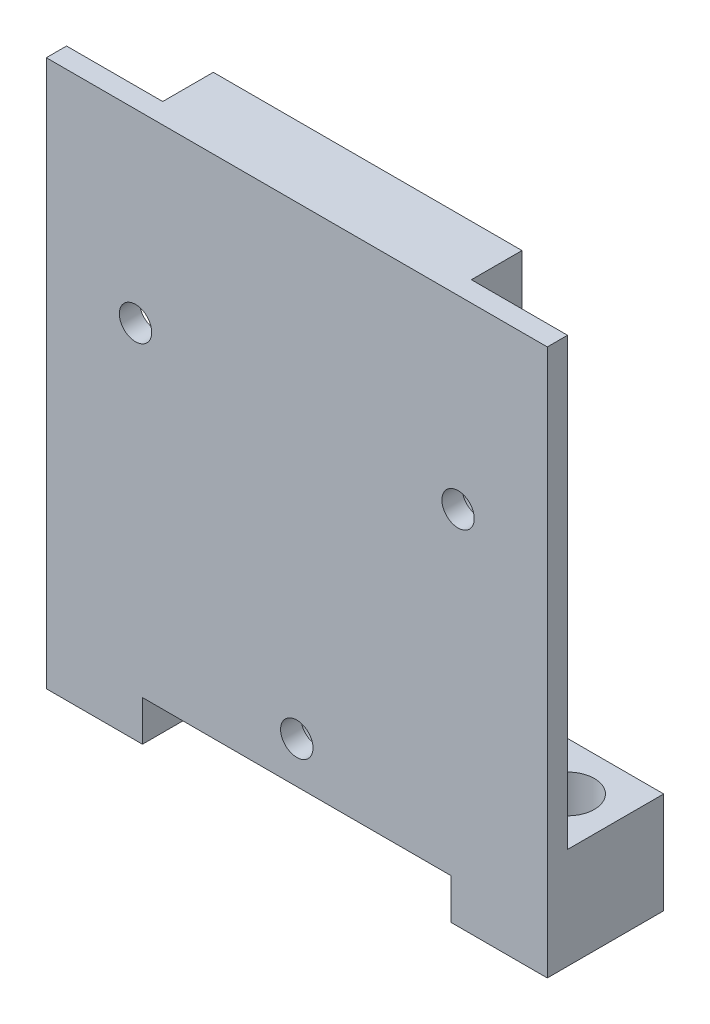
ISO-10303-21;
HEADER;
FILE_DESCRIPTION(('STEP AP214'),'2;1');
FILE_NAME('part.step','',(''),(''),'','','');
FILE_SCHEMA(('AUTOMOTIVE_DESIGN { 1 0 10303 214 1 1 1 1 }'));
ENDSEC;
DATA;
#1=APPLICATION_CONTEXT('core data for automotive mechanical design processes');
#2=APPLICATION_PROTOCOL_DEFINITION('international standard','automotive_design',2000,#1);
#3=PRODUCT_CONTEXT('',#1,'mechanical');
#4=PRODUCT('Part','Part','',(#3));
#5=PRODUCT_RELATED_PRODUCT_CATEGORY('part','',(#4));
#6=PRODUCT_DEFINITION_FORMATION('','',#4);
#7=PRODUCT_DEFINITION_CONTEXT('part definition',#1,'design');
#8=PRODUCT_DEFINITION('design','',#6,#7);
#9=PRODUCT_DEFINITION_SHAPE('','',#8);
#10=(LENGTH_UNIT() NAMED_UNIT(*) SI_UNIT(.MILLI.,.METRE.));
#11=(NAMED_UNIT(*) PLANE_ANGLE_UNIT() SI_UNIT($,.RADIAN.));
#12=(NAMED_UNIT(*) SI_UNIT($,.STERADIAN.) SOLID_ANGLE_UNIT());
#13=UNCERTAINTY_MEASURE_WITH_UNIT(LENGTH_MEASURE(1.E-05),#10,'distance_accuracy_value','');
#14=(GEOMETRIC_REPRESENTATION_CONTEXT(3) GLOBAL_UNCERTAINTY_ASSIGNED_CONTEXT((#13)) GLOBAL_UNIT_ASSIGNED_CONTEXT((#10,
#11,#12)) REPRESENTATION_CONTEXT('',''));
#15=CARTESIAN_POINT('',(0.,0.,0.));
#16=DIRECTION('',(0.,0.,1.));
#17=DIRECTION('',(1.,0.,0.));
#18=AXIS2_PLACEMENT_3D('',#15,#16,#17);
#19=CARTESIAN_POINT('',(0.,4.,2.));
#20=DIRECTION('',(0.,1.,0.));
#21=DIRECTION('',(0.,0.,1.));
#22=AXIS2_PLACEMENT_3D('',#19,#20,#21);
#23=PLANE('',#22);
#24=DIRECTION('',(0.,0.,1.));
#25=VECTOR('',#24,1.);
#26=CARTESIAN_POINT('',(40.,4.,-5.));
#27=LINE('',#26,#25);
#28=CARTESIAN_POINT('',(40.,4.,-5.));
#29=VERTEX_POINT('',#28);
#30=CARTESIAN_POINT('',(40.,4.,2.));
#31=VERTEX_POINT('',#30);
#32=EDGE_CURVE('E54',#29,#31,#27,.T.);
#33=ORIENTED_EDGE('',*,*,#32,.T.);
#34=DIRECTION('',(1.,0.,0.));
#35=VECTOR('',#34,1.);
#36=CARTESIAN_POINT('',(0.,4.,2.));
#37=LINE('',#36,#35);
#38=CARTESIAN_POINT('',(9.5,4.,2.));
#39=VERTEX_POINT('',#38);
#40=EDGE_CURVE('E193',#39,#31,#37,.T.);
#41=ORIENTED_EDGE('',*,*,#40,.F.);
#42=DIRECTION('',(0.,0.,1.));
#43=VECTOR('',#42,1.);
#44=CARTESIAN_POINT('',(9.5,4.,-5.));
#45=LINE('',#44,#43);
#46=CARTESIAN_POINT('',(9.5,4.,-5.));
#47=VERTEX_POINT('',#46);
#48=EDGE_CURVE('E62',#47,#39,#45,.T.);
#49=ORIENTED_EDGE('',*,*,#48,.F.);
#50=DIRECTION('',(-1.,0.,0.));
#51=VECTOR('',#50,1.);
#52=CARTESIAN_POINT('',(0.,4.,-5.));
#53=LINE('',#52,#51);
#54=EDGE_CURVE('E225',#29,#47,#53,.T.);
#55=ORIENTED_EDGE('',*,*,#54,.F.);
#56=EDGE_LOOP('',(#33,#41,#49,#55));
#57=FACE_BOUND('',#56,.T.);
#58=ADVANCED_FACE('F39',(#57),#23,.F.);
#59=CARTESIAN_POINT('',(9.5,10.,-9.5));
#60=DIRECTION('',(-1.,0.,0.));
#61=DIRECTION('',(0.,0.,1.));
#62=AXIS2_PLACEMENT_3D('',#59,#60,#61);
#63=PLANE('',#62);
#64=ORIENTED_EDGE('',*,*,#48,.T.);
#65=DIRECTION('',(0.,-1.,0.));
#66=VECTOR('',#65,1.);
#67=CARTESIAN_POINT('',(9.5,4.,2.));
#68=LINE('',#67,#66);
#69=CARTESIAN_POINT('',(9.5,0.,2.));
#70=VERTEX_POINT('',#69);
#71=EDGE_CURVE('E194',#39,#70,#68,.T.);
#72=ORIENTED_EDGE('',*,*,#71,.T.);
#73=DIRECTION('',(0.,0.,-1.));
#74=VECTOR('',#73,1.);
#75=CARTESIAN_POINT('',(9.5,0.,-9.5));
#76=LINE('',#75,#74);
#77=CARTESIAN_POINT('',(9.5,0.,-9.5));
#78=VERTEX_POINT('',#77);
#79=EDGE_CURVE('E343',#70,#78,#76,.T.);
#80=ORIENTED_EDGE('',*,*,#79,.T.);
#81=DIRECTION('',(0.,-1.,0.));
#82=VECTOR('',#81,1.);
#83=CARTESIAN_POINT('',(9.5,10.,-9.5));
#84=LINE('',#83,#82);
#85=CARTESIAN_POINT('',(9.5,10.,-9.5));
#86=VERTEX_POINT('',#85);
#87=EDGE_CURVE('E348',#86,#78,#84,.T.);
#88=ORIENTED_EDGE('',*,*,#87,.F.);
#89=DIRECTION('',(0.,0.,-1.));
#90=VECTOR('',#89,1.);
#91=CARTESIAN_POINT('',(9.5,10.,-9.5));
#92=LINE('',#91,#90);
#93=CARTESIAN_POINT('',(9.5,10.,-5.));
#94=VERTEX_POINT('',#93);
#95=EDGE_CURVE('E335',#94,#86,#92,.T.);
#96=ORIENTED_EDGE('',*,*,#95,.F.);
#97=DIRECTION('',(0.,1.,0.));
#98=VECTOR('',#97,1.);
#99=CARTESIAN_POINT('',(9.5,0.,-5.));
#100=LINE('',#99,#98);
#101=EDGE_CURVE('E228',#47,#94,#100,.T.);
#102=ORIENTED_EDGE('',*,*,#101,.F.);
#103=EDGE_LOOP('',(#64,#72,#80,#88,#96,#102));
#104=FACE_BOUND('',#103,.T.);
#105=ADVANCED_FACE('F381',(#104),#63,.F.);
#106=CARTESIAN_POINT('',(0.,0.,0.));
#107=DIRECTION('',(0.,0.,-1.));
#108=DIRECTION('',(-1.,0.,0.));
#109=AXIS2_PLACEMENT_3D('',#106,#107,#108);
#110=PLANE('',#109);
#111=CARTESIAN_POINT('',(40.6848674296337,35.6999999999998,0.));
#112=DIRECTION('',(0.,0.,-1.));
#113=DIRECTION('',(-1.,0.,0.));
#114=AXIS2_PLACEMENT_3D('',#111,#112,#113);
#115=CIRCLE('',#114,1.6);
#116=CARTESIAN_POINT('',(39.0848674296337,35.6999999999998,0.));
#117=VERTEX_POINT('',#116);
#118=EDGE_CURVE('E272',#117,#117,#115,.T.);
#119=ORIENTED_EDGE('',*,*,#118,.F.);
#120=EDGE_LOOP('',(#119));
#121=FACE_BOUND('',#120,.T.);
#122=CARTESIAN_POINT('',(40.6848674296337,35.6999999999998,0.));
#123=DIRECTION('',(0.,0.,-1.));
#124=DIRECTION('',(-1.,0.,0.));
#125=AXIS2_PLACEMENT_3D('',#122,#123,#124);
#126=CIRCLE('',#125,3.);
#127=CARTESIAN_POINT('',(40.,32.779219863833,0.));
#128=VERTEX_POINT('',#127);
#129=CARTESIAN_POINT('',(40.,38.6207801361667,0.));
#130=VERTEX_POINT('',#129);
#131=EDGE_CURVE('E240',#128,#130,#126,.T.);
#132=ORIENTED_EDGE('',*,*,#131,.T.);
#133=DIRECTION('',(0.,-1.,0.));
#134=VECTOR('',#133,1.);
#135=CARTESIAN_POINT('',(40.,0.,0.));
#136=LINE('',#135,#134);
#137=CARTESIAN_POINT('',(40.,54.,0.));
#138=VERTEX_POINT('',#137);
#139=EDGE_CURVE('E237',#138,#130,#136,.T.);
#140=ORIENTED_EDGE('',*,*,#139,.F.);
#141=DIRECTION('',(-1.,0.,0.));
#142=VECTOR('',#141,1.);
#143=CARTESIAN_POINT('',(0.,54.,0.));
#144=LINE('',#143,#142);
#145=CARTESIAN_POINT('',(49.5,54.,0.));
#146=VERTEX_POINT('',#145);
#147=EDGE_CURVE('E303',#146,#138,#144,.T.);
#148=ORIENTED_EDGE('',*,*,#147,.F.);
#149=DIRECTION('',(0.,1.,0.));
#150=VECTOR('',#149,1.);
#151=CARTESIAN_POINT('',(49.5,4.,0.));
#152=LINE('',#151,#150);
#153=CARTESIAN_POINT('',(49.5,10.,0.));
#154=VERTEX_POINT('',#153);
#155=EDGE_CURVE('E312',#154,#146,#152,.T.);
#156=ORIENTED_EDGE('',*,*,#155,.F.);
#157=DIRECTION('',(1.,0.,0.));
#158=VECTOR('',#157,1.);
#159=CARTESIAN_POINT('',(40.,10.,0.));
#160=LINE('',#159,#158);
#161=CARTESIAN_POINT('',(40.,10.,0.));
#162=VERTEX_POINT('',#161);
#163=EDGE_CURVE('E285',#162,#154,#160,.T.);
#164=ORIENTED_EDGE('',*,*,#163,.F.);
#165=EDGE_CURVE('E241',#128,#162,#136,.T.);
#166=ORIENTED_EDGE('',*,*,#165,.F.);
#167=EDGE_LOOP('',(#132,#140,#148,#156,#164,#166));
#168=FACE_BOUND('',#167,.T.);
#169=ADVANCED_FACE('F399',(#121,#168),#110,.T.);
#170=CARTESIAN_POINT('',(24.75,8.10000000000001,0.));
#171=DIRECTION('',(0.,0.,-1.));
#172=DIRECTION('',(-1.,0.,0.));
#173=AXIS2_PLACEMENT_3D('',#170,#171,#172);
#174=CIRCLE('',#173,3.);
#175=CARTESIAN_POINT('',(21.75,8.10000000000001,0.));
#176=VERTEX_POINT('',#175);
#177=EDGE_CURVE('E11',#176,#176,#174,.F.);
#178=ORIENTED_EDGE('',*,*,#177,.F.);
#179=EDGE_LOOP('',(#178));
#180=FACE_BOUND('',#179,.T.);
#181=CARTESIAN_POINT('',(24.75,8.10000000000001,0.));
#182=DIRECTION('',(0.,0.,-1.));
#183=DIRECTION('',(-1.,0.,0.));
#184=AXIS2_PLACEMENT_3D('',#181,#182,#183);
#185=CIRCLE('',#184,1.6);
#186=CARTESIAN_POINT('',(23.15,8.10000000000001,0.));
#187=VERTEX_POINT('',#186);
#188=EDGE_CURVE('E264',#187,#187,#185,.T.);
#189=ORIENTED_EDGE('',*,*,#188,.F.);
#190=EDGE_LOOP('',(#189));
#191=FACE_BOUND('',#190,.T.);
#192=ADVANCED_FACE('F435',(#180,#191),#110,.T.);
#193=CARTESIAN_POINT('',(40.,10.,-9.5));
#194=DIRECTION('',(1.,0.,0.));
#195=DIRECTION('',(0.,0.,-1.));
#196=AXIS2_PLACEMENT_3D('',#193,#194,#195);
#197=PLANE('',#196);
#198=ORIENTED_EDGE('',*,*,#32,.F.);
#199=DIRECTION('',(0.,1.,0.));
#200=VECTOR('',#199,1.);
#201=CARTESIAN_POINT('',(40.,10.,-5.));
#202=LINE('',#201,#200);
#203=CARTESIAN_POINT('',(40.,10.,-5.));
#204=VERTEX_POINT('',#203);
#205=EDGE_CURVE('E47',#29,#204,#202,.T.);
#206=ORIENTED_EDGE('',*,*,#205,.T.);
#207=DIRECTION('',(0.,0.,1.));
#208=VECTOR('',#207,1.);
#209=CARTESIAN_POINT('',(40.,10.,-9.5));
#210=LINE('',#209,#208);
#211=CARTESIAN_POINT('',(40.,10.,-9.5));
#212=VERTEX_POINT('',#211);
#213=EDGE_CURVE('E282',#212,#204,#210,.T.);
#214=ORIENTED_EDGE('',*,*,#213,.F.);
#215=DIRECTION('',(0.,-1.,0.));
#216=VECTOR('',#215,1.);
#217=CARTESIAN_POINT('',(40.,10.,-9.5));
#218=LINE('',#217,#216);
#219=CARTESIAN_POINT('',(40.,0.,-9.5));
#220=VERTEX_POINT('',#219);
#221=EDGE_CURVE('E181',#212,#220,#218,.T.);
#222=ORIENTED_EDGE('',*,*,#221,.T.);
#223=DIRECTION('',(0.,0.,1.));
#224=VECTOR('',#223,1.);
#225=CARTESIAN_POINT('',(40.,0.,-9.5));
#226=LINE('',#225,#224);
#227=CARTESIAN_POINT('',(40.,0.,2.));
#228=VERTEX_POINT('',#227);
#229=EDGE_CURVE('E175',#220,#228,#226,.T.);
#230=ORIENTED_EDGE('',*,*,#229,.T.);
#231=DIRECTION('',(0.,1.,0.));
#232=VECTOR('',#231,1.);
#233=CARTESIAN_POINT('',(40.,4.,2.));
#234=LINE('',#233,#232);
#235=EDGE_CURVE('E178',#228,#31,#234,.T.);
#236=ORIENTED_EDGE('',*,*,#235,.T.);
#237=EDGE_LOOP('',(#198,#206,#214,#222,#230,#236));
#238=FACE_BOUND('',#237,.T.);
#239=ADVANCED_FACE('F177',(#238),#197,.F.);
#240=CARTESIAN_POINT('',(0.,10.,0.));
#241=DIRECTION('',(0.,1.,0.));
#242=DIRECTION('',(0.,0.,1.));
#243=AXIS2_PLACEMENT_3D('',#240,#241,#242);
#244=PLANE('',#243);
#245=DIRECTION('',(0.,0.,1.));
#246=VECTOR('',#245,1.);
#247=CARTESIAN_POINT('',(0.,10.,-9.5));
#248=LINE('',#247,#246);
#249=CARTESIAN_POINT('',(0.,10.,-9.5));
#250=VERTEX_POINT('',#249);
#251=CARTESIAN_POINT('',(0.,10.,0.));
#252=VERTEX_POINT('',#251);
#253=EDGE_CURVE('E329',#250,#252,#248,.T.);
#254=ORIENTED_EDGE('',*,*,#253,.T.);
#255=DIRECTION('',(1.,0.,0.));
#256=VECTOR('',#255,1.);
#257=CARTESIAN_POINT('',(0.,10.,0.));
#258=LINE('',#257,#256);
#259=CARTESIAN_POINT('',(9.5,10.,0.));
#260=VERTEX_POINT('',#259);
#261=EDGE_CURVE('E331',#252,#260,#258,.T.);
#262=ORIENTED_EDGE('',*,*,#261,.T.);
#263=EDGE_CURVE('E336',#260,#94,#92,.T.);
#264=ORIENTED_EDGE('',*,*,#263,.T.);
#265=ORIENTED_EDGE('',*,*,#95,.T.);
#266=DIRECTION('',(-1.,0.,0.));
#267=VECTOR('',#266,1.);
#268=CARTESIAN_POINT('',(0.,10.,-9.5));
#269=LINE('',#268,#267);
#270=EDGE_CURVE('E339',#86,#250,#269,.T.);
#271=ORIENTED_EDGE('',*,*,#270,.T.);
#272=EDGE_LOOP('',(#254,#262,#264,#265,#271));
#273=FACE_BOUND('',#272,.T.);
#274=CARTESIAN_POINT('',(4.75,10.,-4.75));
#275=DIRECTION('',(0.,1.,0.));
#276=DIRECTION('',(0.,0.,1.));
#277=AXIS2_PLACEMENT_3D('',#274,#275,#276);
#278=CIRCLE('',#277,2.65);
#279=CARTESIAN_POINT('',(4.75,10.,-2.1));
#280=VERTEX_POINT('',#279);
#281=EDGE_CURVE('E323',#280,#280,#278,.T.);
#282=ORIENTED_EDGE('',*,*,#281,.F.);
#283=EDGE_LOOP('',(#282));
#284=FACE_BOUND('',#283,.T.);
#285=ADVANCED_FACE('F388',(#273,#284),#244,.T.);
#286=CARTESIAN_POINT('',(0.,0.,0.));
#287=DIRECTION('',(0.,1.,0.));
#288=DIRECTION('',(0.,0.,1.));
#289=AXIS2_PLACEMENT_3D('',#286,#287,#288);
#290=PLANE('',#289);
#291=DIRECTION('',(0.,0.,1.));
#292=VECTOR('',#291,1.);
#293=CARTESIAN_POINT('',(0.,0.,-9.5));
#294=LINE('',#293,#292);
#295=CARTESIAN_POINT('',(0.,0.,-9.5));
#296=VERTEX_POINT('',#295);
#297=CARTESIAN_POINT('',(0.,0.,2.));
#298=VERTEX_POINT('',#297);
#299=EDGE_CURVE('E326',#296,#298,#294,.T.);
#300=ORIENTED_EDGE('',*,*,#299,.F.);
#301=DIRECTION('',(-1.,0.,0.));
#302=VECTOR('',#301,1.);
#303=CARTESIAN_POINT('',(0.,0.,-9.5));
#304=LINE('',#303,#302);
#305=EDGE_CURVE('E332',#78,#296,#304,.T.);
#306=ORIENTED_EDGE('',*,*,#305,.F.);
#307=ORIENTED_EDGE('',*,*,#79,.F.);
#308=DIRECTION('',(-1.,0.,0.));
#309=VECTOR('',#308,1.);
#310=CARTESIAN_POINT('',(0.,0.,2.));
#311=LINE('',#310,#309);
#312=EDGE_CURVE('E202',#70,#298,#311,.T.);
#313=ORIENTED_EDGE('',*,*,#312,.T.);
#314=EDGE_LOOP('',(#300,#306,#307,#313));
#315=FACE_BOUND('',#314,.T.);
#316=CARTESIAN_POINT('',(4.75,0.,-4.75));
#317=DIRECTION('',(0.,1.,0.));
#318=DIRECTION('',(0.,0.,1.));
#319=AXIS2_PLACEMENT_3D('',#316,#317,#318);
#320=CIRCLE('',#319,2.65);
#321=CARTESIAN_POINT('',(4.75,0.,-2.1));
#322=VERTEX_POINT('',#321);
#323=EDGE_CURVE('E322',#322,#322,#320,.T.);
#324=ORIENTED_EDGE('',*,*,#323,.T.);
#325=EDGE_LOOP('',(#324));
#326=FACE_BOUND('',#325,.T.);
#327=ADVANCED_FACE('F379',(#315,#326),#290,.F.);
#328=CARTESIAN_POINT('',(0.,10.,-9.5));
#329=DIRECTION('',(1.,0.,0.));
#330=DIRECTION('',(0.,0.,-1.));
#331=AXIS2_PLACEMENT_3D('',#328,#329,#330);
#332=PLANE('',#331);
#333=ORIENTED_EDGE('',*,*,#299,.T.);
#334=DIRECTION('',(0.,-1.,0.));
#335=VECTOR('',#334,1.);
#336=CARTESIAN_POINT('',(0.,4.,2.));
#337=LINE('',#336,#335);
#338=CARTESIAN_POINT('',(0.,54.,2.));
#339=VERTEX_POINT('',#338);
#340=EDGE_CURVE('E301',#339,#298,#337,.T.);
#341=ORIENTED_EDGE('',*,*,#340,.F.);
#342=DIRECTION('',(0.,0.,-1.));
#343=VECTOR('',#342,1.);
#344=CARTESIAN_POINT('',(0.,54.,2.));
#345=LINE('',#344,#343);
#346=CARTESIAN_POINT('',(0.,54.,0.));
#347=VERTEX_POINT('',#346);
#348=EDGE_CURVE('E309',#339,#347,#345,.T.);
#349=ORIENTED_EDGE('',*,*,#348,.T.);
#350=DIRECTION('',(0.,-1.,0.));
#351=VECTOR('',#350,1.);
#352=CARTESIAN_POINT('',(0.,4.,0.));
#353=LINE('',#352,#351);
#354=EDGE_CURVE('E300',#347,#252,#353,.T.);
#355=ORIENTED_EDGE('',*,*,#354,.T.);
#356=ORIENTED_EDGE('',*,*,#253,.F.);
#357=DIRECTION('',(0.,-1.,0.));
#358=VECTOR('',#357,1.);
#359=CARTESIAN_POINT('',(0.,10.,-9.5));
#360=LINE('',#359,#358);
#361=EDGE_CURVE('E341',#250,#296,#360,.T.);
#362=ORIENTED_EDGE('',*,*,#361,.T.);
#363=EDGE_LOOP('',(#333,#341,#349,#355,#356,#362));
#364=FACE_BOUND('',#363,.T.);
#365=ADVANCED_FACE('F41',(#364),#332,.F.);
#366=CARTESIAN_POINT('',(0.,10.,-9.5));
#367=DIRECTION('',(0.,0.,1.));
#368=DIRECTION('',(1.,0.,0.));
#369=AXIS2_PLACEMENT_3D('',#366,#367,#368);
#370=PLANE('',#369);
#371=ORIENTED_EDGE('',*,*,#305,.T.);
#372=ORIENTED_EDGE('',*,*,#361,.F.);
#373=ORIENTED_EDGE('',*,*,#270,.F.);
#374=ORIENTED_EDGE('',*,*,#87,.T.);
#375=EDGE_LOOP('',(#371,#372,#373,#374));
#376=FACE_BOUND('',#375,.T.);
#377=ADVANCED_FACE('F386',(#376),#370,.F.);
#378=CARTESIAN_POINT('',(4.75,10.,-4.75));
#379=DIRECTION('',(0.,-1.,0.));
#380=DIRECTION('',(0.,0.,-1.));
#381=AXIS2_PLACEMENT_3D('',#378,#379,#380);
#382=CYLINDRICAL_SURFACE('',#381,2.65);
#383=ORIENTED_EDGE('',*,*,#281,.T.);
#384=EDGE_LOOP('',(#383));
#385=FACE_BOUND('',#384,.T.);
#386=ORIENTED_EDGE('',*,*,#323,.F.);
#387=EDGE_LOOP('',(#386));
#388=FACE_BOUND('',#387,.T.);
#389=ADVANCED_FACE('F403',(#385,#388),#382,.F.);
#390=DIRECTION('',(0.,-1.,0.));
#391=VECTOR('',#390,1.);
#392=CARTESIAN_POINT('',(9.5,0.,0.));
#393=LINE('',#392,#391);
#394=CARTESIAN_POINT('',(9.5,54.,0.));
#395=VERTEX_POINT('',#394);
#396=CARTESIAN_POINT('',(9.5,38.620780136167,0.));
#397=VERTEX_POINT('',#396);
#398=EDGE_CURVE('E234',#395,#397,#393,.T.);
#399=ORIENTED_EDGE('',*,*,#398,.T.);
#400=CARTESIAN_POINT('',(8.81513257036638,35.7000000000001,0.));
#401=DIRECTION('',(0.,0.,-1.));
#402=DIRECTION('',(-1.,0.,0.));
#403=AXIS2_PLACEMENT_3D('',#400,#401,#402);
#404=CIRCLE('',#403,3.);
#405=CARTESIAN_POINT('',(9.5,32.7792198638332,0.));
#406=VERTEX_POINT('',#405);
#407=EDGE_CURVE('E205',#397,#406,#404,.T.);
#408=ORIENTED_EDGE('',*,*,#407,.T.);
#409=DIRECTION('',(0.,1.,0.));
#410=VECTOR('',#409,1.);
#411=CARTESIAN_POINT('',(9.5,0.,0.));
#412=LINE('',#411,#410);
#413=EDGE_CURVE('E210',#260,#406,#412,.T.);
#414=ORIENTED_EDGE('',*,*,#413,.F.);
#415=ORIENTED_EDGE('',*,*,#261,.F.);
#416=ORIENTED_EDGE('',*,*,#354,.F.);
#417=EDGE_CURVE('E314',#395,#347,#144,.T.);
#418=ORIENTED_EDGE('',*,*,#417,.F.);
#419=EDGE_LOOP('',(#399,#408,#414,#415,#416,#418));
#420=FACE_BOUND('',#419,.T.);
#421=CARTESIAN_POINT('',(8.81513257036638,35.7000000000001,0.));
#422=DIRECTION('',(0.,0.,-1.));
#423=DIRECTION('',(-1.,0.,0.));
#424=AXIS2_PLACEMENT_3D('',#421,#422,#423);
#425=CIRCLE('',#424,1.60000000000001);
#426=CARTESIAN_POINT('',(7.21513257036637,35.7000000000001,0.));
#427=VERTEX_POINT('',#426);
#428=EDGE_CURVE('E259',#427,#427,#425,.T.);
#429=ORIENTED_EDGE('',*,*,#428,.F.);
#430=EDGE_LOOP('',(#429));
#431=FACE_BOUND('',#430,.T.);
#432=ADVANCED_FACE('F406',(#420,#431),#110,.T.);
#433=CARTESIAN_POINT('',(49.5,4.,2.));
#434=DIRECTION('',(-1.,0.,0.));
#435=DIRECTION('',(0.,0.,1.));
#436=AXIS2_PLACEMENT_3D('',#433,#434,#435);
#437=PLANE('',#436);
#438=DIRECTION('',(0.,1.,0.));
#439=VECTOR('',#438,1.);
#440=CARTESIAN_POINT('',(49.5,4.,2.));
#441=LINE('',#440,#439);
#442=CARTESIAN_POINT('',(49.5,0.,2.));
#443=VERTEX_POINT('',#442);
#444=CARTESIAN_POINT('',(49.5,54.,2.));
#445=VERTEX_POINT('',#444);
#446=EDGE_CURVE('E305',#443,#445,#441,.T.);
#447=ORIENTED_EDGE('',*,*,#446,.F.);
#448=DIRECTION('',(0.,0.,-1.));
#449=VECTOR('',#448,1.);
#450=CARTESIAN_POINT('',(49.5,0.,-9.50000000000001));
#451=LINE('',#450,#449);
#452=CARTESIAN_POINT('',(49.5,0.,-9.50000000000001));
#453=VERTEX_POINT('',#452);
#454=EDGE_CURVE('E185',#443,#453,#451,.T.);
#455=ORIENTED_EDGE('',*,*,#454,.T.);
#456=DIRECTION('',(0.,-1.,0.));
#457=VECTOR('',#456,1.);
#458=CARTESIAN_POINT('',(49.5,10.,-9.50000000000001));
#459=LINE('',#458,#457);
#460=CARTESIAN_POINT('',(49.5,10.,-9.50000000000001));
#461=VERTEX_POINT('',#460);
#462=EDGE_CURVE('E297',#461,#453,#459,.T.);
#463=ORIENTED_EDGE('',*,*,#462,.F.);
#464=DIRECTION('',(0.,0.,-1.));
#465=VECTOR('',#464,1.);
#466=CARTESIAN_POINT('',(49.5,10.,-9.50000000000001));
#467=LINE('',#466,#465);
#468=EDGE_CURVE('E289',#154,#461,#467,.T.);
#469=ORIENTED_EDGE('',*,*,#468,.F.);
#470=ORIENTED_EDGE('',*,*,#155,.T.);
#471=DIRECTION('',(0.,0.,-1.));
#472=VECTOR('',#471,1.);
#473=CARTESIAN_POINT('',(49.5,54.,2.));
#474=LINE('',#473,#472);
#475=EDGE_CURVE('E319',#445,#146,#474,.T.);
#476=ORIENTED_EDGE('',*,*,#475,.F.);
#477=EDGE_LOOP('',(#447,#455,#463,#469,#470,#476));
#478=FACE_BOUND('',#477,.T.);
#479=ADVANCED_FACE('F363',(#478),#437,.F.);
#480=CARTESIAN_POINT('',(0.,54.,2.));
#481=DIRECTION('',(0.,-1.,0.));
#482=DIRECTION('',(0.,0.,-1.));
#483=AXIS2_PLACEMENT_3D('',#480,#481,#482);
#484=PLANE('',#483);
#485=ORIENTED_EDGE('',*,*,#147,.T.);
#486=DIRECTION('',(0.,0.,1.));
#487=VECTOR('',#486,1.);
#488=CARTESIAN_POINT('',(40.,54.,-5.));
#489=LINE('',#488,#487);
#490=CARTESIAN_POINT('',(40.,54.,-5.));
#491=VERTEX_POINT('',#490);
#492=EDGE_CURVE('E253',#491,#138,#489,.T.);
#493=ORIENTED_EDGE('',*,*,#492,.F.);
#494=DIRECTION('',(1.,0.,0.));
#495=VECTOR('',#494,1.);
#496=CARTESIAN_POINT('',(0.,54.,-5.));
#497=LINE('',#496,#495);
#498=CARTESIAN_POINT('',(9.5,54.,-5.));
#499=VERTEX_POINT('',#498);
#500=EDGE_CURVE('E216',#499,#491,#497,.T.);
#501=ORIENTED_EDGE('',*,*,#500,.F.);
#502=DIRECTION('',(0.,0.,1.));
#503=VECTOR('',#502,1.);
#504=CARTESIAN_POINT('',(9.5,54.,-5.));
#505=LINE('',#504,#503);
#506=EDGE_CURVE('E255',#499,#395,#505,.T.);
#507=ORIENTED_EDGE('',*,*,#506,.T.);
#508=ORIENTED_EDGE('',*,*,#417,.T.);
#509=ORIENTED_EDGE('',*,*,#348,.F.);
#510=DIRECTION('',(-1.,0.,0.));
#511=VECTOR('',#510,1.);
#512=CARTESIAN_POINT('',(0.,54.,2.));
#513=LINE('',#512,#511);
#514=EDGE_CURVE('E307',#445,#339,#513,.T.);
#515=ORIENTED_EDGE('',*,*,#514,.F.);
#516=ORIENTED_EDGE('',*,*,#475,.T.);
#517=EDGE_LOOP('',(#485,#493,#501,#507,#508,#509,#515,#516));
#518=FACE_BOUND('',#517,.T.);
#519=ADVANCED_FACE('F370',(#518),#484,.F.);
#520=CARTESIAN_POINT('',(0.,0.,2.));
#521=DIRECTION('',(0.,0.,-1.));
#522=DIRECTION('',(-1.,0.,0.));
#523=AXIS2_PLACEMENT_3D('',#520,#521,#522);
#524=PLANE('',#523);
#525=CARTESIAN_POINT('',(24.75,8.10000000000001,2.));
#526=DIRECTION('',(0.,0.,-1.));
#527=DIRECTION('',(-1.,0.,0.));
#528=AXIS2_PLACEMENT_3D('',#525,#526,#527);
#529=CIRCLE('',#528,1.6);
#530=CARTESIAN_POINT('',(23.15,8.10000000000001,2.));
#531=VERTEX_POINT('',#530);
#532=EDGE_CURVE('E260',#531,#531,#529,.T.);
#533=ORIENTED_EDGE('',*,*,#532,.T.);
#534=EDGE_LOOP('',(#533));
#535=FACE_BOUND('',#534,.T.);
#536=CARTESIAN_POINT('',(8.81513257036638,35.7000000000001,2.));
#537=DIRECTION('',(0.,0.,-1.));
#538=DIRECTION('',(-1.,0.,0.));
#539=AXIS2_PLACEMENT_3D('',#536,#537,#538);
#540=CIRCLE('',#539,1.60000000000001);
#541=CARTESIAN_POINT('',(7.21513257036637,35.7000000000001,2.));
#542=VERTEX_POINT('',#541);
#543=EDGE_CURVE('E267',#542,#542,#540,.T.);
#544=ORIENTED_EDGE('',*,*,#543,.T.);
#545=EDGE_LOOP('',(#544));
#546=FACE_BOUND('',#545,.T.);
#547=CARTESIAN_POINT('',(40.6848674296337,35.6999999999998,2.));
#548=DIRECTION('',(0.,0.,-1.));
#549=DIRECTION('',(-1.,0.,0.));
#550=AXIS2_PLACEMENT_3D('',#547,#548,#549);
#551=CIRCLE('',#550,1.6);
#552=CARTESIAN_POINT('',(39.0848674296337,35.6999999999998,2.));
#553=VERTEX_POINT('',#552);
#554=EDGE_CURVE('E263',#553,#553,#551,.T.);
#555=ORIENTED_EDGE('',*,*,#554,.T.);
#556=EDGE_LOOP('',(#555));
#557=FACE_BOUND('',#556,.T.);
#558=ORIENTED_EDGE('',*,*,#340,.T.);
#559=ORIENTED_EDGE('',*,*,#312,.F.);
#560=ORIENTED_EDGE('',*,*,#71,.F.);
#561=ORIENTED_EDGE('',*,*,#40,.T.);
#562=ORIENTED_EDGE('',*,*,#235,.F.);
#563=DIRECTION('',(-1.,0.,0.));
#564=VECTOR('',#563,1.);
#565=CARTESIAN_POINT('',(40.,0.,2.));
#566=LINE('',#565,#564);
#567=EDGE_CURVE('E192',#443,#228,#566,.T.);
#568=ORIENTED_EDGE('',*,*,#567,.F.);
#569=ORIENTED_EDGE('',*,*,#446,.T.);
#570=ORIENTED_EDGE('',*,*,#514,.T.);
#571=EDGE_LOOP('',(#558,#559,#560,#561,#562,#568,#569,#570));
#572=FACE_BOUND('',#571,.T.);
#573=ADVANCED_FACE('F191',(#535,#546,#557,#572),#524,.F.);
#574=CARTESIAN_POINT('',(0.,10.,0.));
#575=DIRECTION('',(0.,1.,0.));
#576=DIRECTION('',(0.,0.,1.));
#577=AXIS2_PLACEMENT_3D('',#574,#575,#576);
#578=PLANE('',#577);
#579=ORIENTED_EDGE('',*,*,#213,.T.);
#580=EDGE_CURVE('E286',#204,#162,#210,.T.);
#581=ORIENTED_EDGE('',*,*,#580,.T.);
#582=ORIENTED_EDGE('',*,*,#163,.T.);
#583=ORIENTED_EDGE('',*,*,#468,.T.);
#584=DIRECTION('',(-1.,0.,0.));
#585=VECTOR('',#584,1.);
#586=CARTESIAN_POINT('',(40.,10.,-9.5));
#587=LINE('',#586,#585);
#588=EDGE_CURVE('E291',#461,#212,#587,.T.);
#589=ORIENTED_EDGE('',*,*,#588,.T.);
#590=EDGE_LOOP('',(#579,#581,#582,#583,#589));
#591=FACE_BOUND('',#590,.T.);
#592=CARTESIAN_POINT('',(44.75,10.,-4.75000000000001));
#593=DIRECTION('',(0.,1.,0.));
#594=DIRECTION('',(0.,0.,1.));
#595=AXIS2_PLACEMENT_3D('',#592,#593,#594);
#596=CIRCLE('',#595,2.65);
#597=CARTESIAN_POINT('',(44.75,10.,-2.10000000000001));
#598=VERTEX_POINT('',#597);
#599=EDGE_CURVE('E186',#598,#598,#596,.T.);
#600=ORIENTED_EDGE('',*,*,#599,.F.);
#601=EDGE_LOOP('',(#600));
#602=FACE_BOUND('',#601,.T.);
#603=ADVANCED_FACE('F354',(#591,#602),#578,.T.);
#604=CARTESIAN_POINT('',(0.,0.,0.));
#605=DIRECTION('',(0.,1.,0.));
#606=DIRECTION('',(0.,0.,1.));
#607=AXIS2_PLACEMENT_3D('',#604,#605,#606);
#608=PLANE('',#607);
#609=ORIENTED_EDGE('',*,*,#229,.F.);
#610=DIRECTION('',(-1.,0.,0.));
#611=VECTOR('',#610,1.);
#612=CARTESIAN_POINT('',(40.,0.,-9.5));
#613=LINE('',#612,#611);
#614=EDGE_CURVE('E294',#453,#220,#613,.T.);
#615=ORIENTED_EDGE('',*,*,#614,.F.);
#616=ORIENTED_EDGE('',*,*,#454,.F.);
#617=ORIENTED_EDGE('',*,*,#567,.T.);
#618=EDGE_LOOP('',(#609,#615,#616,#617));
#619=FACE_BOUND('',#618,.T.);
#620=CARTESIAN_POINT('',(44.75,0.,-4.75000000000001));
#621=DIRECTION('',(0.,1.,0.));
#622=DIRECTION('',(0.,0.,1.));
#623=AXIS2_PLACEMENT_3D('',#620,#621,#622);
#624=CIRCLE('',#623,2.65);
#625=CARTESIAN_POINT('',(44.75,0.,-2.10000000000001));
#626=VERTEX_POINT('',#625);
#627=EDGE_CURVE('E275',#626,#626,#624,.T.);
#628=ORIENTED_EDGE('',*,*,#627,.T.);
#629=EDGE_LOOP('',(#628));
#630=FACE_BOUND('',#629,.T.);
#631=ADVANCED_FACE('F197',(#619,#630),#608,.F.);
#632=CARTESIAN_POINT('',(40.,10.,-9.5));
#633=DIRECTION('',(0.,0.,1.));
#634=DIRECTION('',(1.,0.,0.));
#635=AXIS2_PLACEMENT_3D('',#632,#633,#634);
#636=PLANE('',#635);
#637=ORIENTED_EDGE('',*,*,#614,.T.);
#638=ORIENTED_EDGE('',*,*,#221,.F.);
#639=ORIENTED_EDGE('',*,*,#588,.F.);
#640=ORIENTED_EDGE('',*,*,#462,.T.);
#641=EDGE_LOOP('',(#637,#638,#639,#640));
#642=FACE_BOUND('',#641,.T.);
#643=ADVANCED_FACE('F361',(#642),#636,.F.);
#644=CARTESIAN_POINT('',(44.75,10.,-4.75000000000001));
#645=DIRECTION('',(0.,-1.,0.));
#646=DIRECTION('',(0.,0.,-1.));
#647=AXIS2_PLACEMENT_3D('',#644,#645,#646);
#648=CYLINDRICAL_SURFACE('',#647,2.65);
#649=ORIENTED_EDGE('',*,*,#599,.T.);
#650=EDGE_LOOP('',(#649));
#651=FACE_BOUND('',#650,.T.);
#652=ORIENTED_EDGE('',*,*,#627,.F.);
#653=EDGE_LOOP('',(#652));
#654=FACE_BOUND('',#653,.T.);
#655=ADVANCED_FACE('F603',(#651,#654),#648,.F.);
#656=CARTESIAN_POINT('',(40.6848674296337,35.6999999999998,0.));
#657=DIRECTION('',(0.,0.,1.));
#658=DIRECTION('',(1.,0.,0.));
#659=AXIS2_PLACEMENT_3D('',#656,#657,#658);
#660=CYLINDRICAL_SURFACE('',#659,1.6);
#661=ORIENTED_EDGE('',*,*,#118,.T.);
#662=EDGE_LOOP('',(#661));
#663=FACE_BOUND('',#662,.T.);
#664=ORIENTED_EDGE('',*,*,#554,.F.);
#665=EDGE_LOOP('',(#664));
#666=FACE_BOUND('',#665,.T.);
#667=ADVANCED_FACE('F610',(#663,#666),#660,.F.);
#668=CARTESIAN_POINT('',(8.81513257036638,35.7000000000001,0.));
#669=DIRECTION('',(0.,0.,1.));
#670=DIRECTION('',(1.,0.,0.));
#671=AXIS2_PLACEMENT_3D('',#668,#669,#670);
#672=CYLINDRICAL_SURFACE('',#671,1.60000000000001);
#673=ORIENTED_EDGE('',*,*,#428,.T.);
#674=EDGE_LOOP('',(#673));
#675=FACE_BOUND('',#674,.T.);
#676=ORIENTED_EDGE('',*,*,#543,.F.);
#677=EDGE_LOOP('',(#676));
#678=FACE_BOUND('',#677,.T.);
#679=ADVANCED_FACE('F618',(#675,#678),#672,.F.);
#680=CARTESIAN_POINT('',(24.75,8.10000000000001,0.));
#681=DIRECTION('',(0.,0.,1.));
#682=DIRECTION('',(1.,0.,0.));
#683=AXIS2_PLACEMENT_3D('',#680,#681,#682);
#684=CYLINDRICAL_SURFACE('',#683,1.6);
#685=ORIENTED_EDGE('',*,*,#188,.T.);
#686=EDGE_LOOP('',(#685));
#687=FACE_BOUND('',#686,.T.);
#688=ORIENTED_EDGE('',*,*,#532,.F.);
#689=EDGE_LOOP('',(#688));
#690=FACE_BOUND('',#689,.T.);
#691=ADVANCED_FACE('F540',(#687,#690),#684,.F.);
#692=CARTESIAN_POINT('',(8.81513257036638,35.7000000000001,-5.));
#693=DIRECTION('',(0.,0.,1.));
#694=DIRECTION('',(1.,0.,0.));
#695=AXIS2_PLACEMENT_3D('',#692,#693,#694);
#696=CYLINDRICAL_SURFACE('',#695,3.);
#697=ORIENTED_EDGE('',*,*,#407,.F.);
#698=DIRECTION('',(0.,0.,1.));
#699=VECTOR('',#698,1.);
#700=CARTESIAN_POINT('',(9.5,38.620780136167,-5.));
#701=LINE('',#700,#699);
#702=CARTESIAN_POINT('',(9.5,38.620780136167,-5.));
#703=VERTEX_POINT('',#702);
#704=EDGE_CURVE('E257',#703,#397,#701,.T.);
#705=ORIENTED_EDGE('',*,*,#704,.F.);
#706=CARTESIAN_POINT('',(8.81513257036638,35.7000000000001,-5.));
#707=DIRECTION('',(0.,0.,-1.));
#708=DIRECTION('',(-1.,0.,0.));
#709=AXIS2_PLACEMENT_3D('',#706,#707,#708);
#710=CIRCLE('',#709,3.);
#711=CARTESIAN_POINT('',(9.5,32.7792198638332,-5.));
#712=VERTEX_POINT('',#711);
#713=EDGE_CURVE('E209',#703,#712,#710,.T.);
#714=ORIENTED_EDGE('',*,*,#713,.T.);
#715=DIRECTION('',(0.,0.,1.));
#716=VECTOR('',#715,1.);
#717=CARTESIAN_POINT('',(9.5,32.7792198638332,-5.));
#718=LINE('',#717,#716);
#719=EDGE_CURVE('E231',#712,#406,#718,.T.);
#720=ORIENTED_EDGE('',*,*,#719,.T.);
#721=EDGE_LOOP('',(#697,#705,#714,#720));
#722=FACE_BOUND('',#721,.T.);
#723=ADVANCED_FACE('F530',(#722),#696,.F.);
#724=CARTESIAN_POINT('',(9.5,0.,-5.));
#725=DIRECTION('',(-1.,0.,0.));
#726=DIRECTION('',(0.,-1.,0.));
#727=AXIS2_PLACEMENT_3D('',#724,#725,#726);
#728=PLANE('',#727);
#729=ORIENTED_EDGE('',*,*,#398,.F.);
#730=ORIENTED_EDGE('',*,*,#506,.F.);
#731=DIRECTION('',(0.,-1.,0.));
#732=VECTOR('',#731,1.);
#733=CARTESIAN_POINT('',(9.5,0.,-5.));
#734=LINE('',#733,#732);
#735=EDGE_CURVE('E213',#499,#703,#734,.T.);
#736=ORIENTED_EDGE('',*,*,#735,.T.);
#737=ORIENTED_EDGE('',*,*,#704,.T.);
#738=EDGE_LOOP('',(#729,#730,#736,#737));
#739=FACE_BOUND('',#738,.T.);
#740=ADVANCED_FACE('F521',(#739),#728,.T.);
#741=CARTESIAN_POINT('',(40.,0.,-5.));
#742=DIRECTION('',(-1.,0.,0.));
#743=DIRECTION('',(0.,-1.,0.));
#744=AXIS2_PLACEMENT_3D('',#741,#742,#743);
#745=PLANE('',#744);
#746=ORIENTED_EDGE('',*,*,#139,.T.);
#747=DIRECTION('',(0.,0.,1.));
#748=VECTOR('',#747,1.);
#749=CARTESIAN_POINT('',(40.,38.6207801361667,-5.));
#750=LINE('',#749,#748);
#751=CARTESIAN_POINT('',(40.,38.6207801361667,-5.));
#752=VERTEX_POINT('',#751);
#753=EDGE_CURVE('E251',#752,#130,#750,.T.);
#754=ORIENTED_EDGE('',*,*,#753,.F.);
#755=DIRECTION('',(0.,-1.,0.));
#756=VECTOR('',#755,1.);
#757=CARTESIAN_POINT('',(40.,0.,-5.));
#758=LINE('',#757,#756);
#759=EDGE_CURVE('E219',#491,#752,#758,.T.);
#760=ORIENTED_EDGE('',*,*,#759,.F.);
#761=ORIENTED_EDGE('',*,*,#492,.T.);
#762=EDGE_LOOP('',(#746,#754,#760,#761));
#763=FACE_BOUND('',#762,.T.);
#764=ADVANCED_FACE('F503',(#763),#745,.F.);
#765=CARTESIAN_POINT('',(40.6848674296337,35.6999999999998,-5.));
#766=DIRECTION('',(0.,0.,1.));
#767=DIRECTION('',(1.,0.,0.));
#768=AXIS2_PLACEMENT_3D('',#765,#766,#767);
#769=CYLINDRICAL_SURFACE('',#768,3.);
#770=ORIENTED_EDGE('',*,*,#131,.F.);
#771=DIRECTION('',(0.,0.,1.));
#772=VECTOR('',#771,1.);
#773=CARTESIAN_POINT('',(40.,32.779219863833,-5.));
#774=LINE('',#773,#772);
#775=CARTESIAN_POINT('',(40.,32.779219863833,-5.));
#776=VERTEX_POINT('',#775);
#777=EDGE_CURVE('E249',#776,#128,#774,.T.);
#778=ORIENTED_EDGE('',*,*,#777,.F.);
#779=CARTESIAN_POINT('',(40.6848674296337,35.6999999999998,-5.));
#780=DIRECTION('',(0.,0.,-1.));
#781=DIRECTION('',(-1.,0.,0.));
#782=AXIS2_PLACEMENT_3D('',#779,#780,#781);
#783=CIRCLE('',#782,3.);
#784=EDGE_CURVE('E221',#776,#752,#783,.T.);
#785=ORIENTED_EDGE('',*,*,#784,.T.);
#786=ORIENTED_EDGE('',*,*,#753,.T.);
#787=EDGE_LOOP('',(#770,#778,#785,#786));
#788=FACE_BOUND('',#787,.T.);
#789=ADVANCED_FACE('F500',(#788),#769,.F.);
#790=ORIENTED_EDGE('',*,*,#580,.F.);
#791=EDGE_CURVE('E222',#776,#204,#758,.T.);
#792=ORIENTED_EDGE('',*,*,#791,.F.);
#793=ORIENTED_EDGE('',*,*,#777,.T.);
#794=ORIENTED_EDGE('',*,*,#165,.T.);
#795=EDGE_LOOP('',(#790,#792,#793,#794));
#796=FACE_BOUND('',#795,.T.);
#797=ADVANCED_FACE('F490',(#796),#745,.F.);
#798=CARTESIAN_POINT('',(24.75,8.10000000000001,-5.));
#799=DIRECTION('',(0.,0.,1.));
#800=DIRECTION('',(1.,0.,0.));
#801=AXIS2_PLACEMENT_3D('',#798,#799,#800);
#802=CYLINDRICAL_SURFACE('',#801,3.);
#803=CARTESIAN_POINT('',(24.75,8.10000000000001,-5.));
#804=DIRECTION('',(0.,0.,-1.));
#805=DIRECTION('',(-1.,0.,0.));
#806=AXIS2_PLACEMENT_3D('',#803,#804,#805);
#807=CIRCLE('',#806,3.);
#808=CARTESIAN_POINT('',(21.75,8.10000000000001,-5.));
#809=VERTEX_POINT('',#808);
#810=EDGE_CURVE('E206',#809,#809,#807,.T.);
#811=ORIENTED_EDGE('',*,*,#810,.T.);
#812=EDGE_LOOP('',(#811));
#813=FACE_BOUND('',#812,.T.);
#814=ORIENTED_EDGE('',*,*,#177,.T.);
#815=EDGE_LOOP('',(#814));
#816=FACE_BOUND('',#815,.T.);
#817=ADVANCED_FACE('F479',(#813,#816),#802,.F.);
#818=CARTESIAN_POINT('',(9.5,0.,-5.));
#819=DIRECTION('',(1.,0.,0.));
#820=DIRECTION('',(0.,0.,-1.));
#821=AXIS2_PLACEMENT_3D('',#818,#819,#820);
#822=PLANE('',#821);
#823=ORIENTED_EDGE('',*,*,#263,.F.);
#824=ORIENTED_EDGE('',*,*,#413,.T.);
#825=ORIENTED_EDGE('',*,*,#719,.F.);
#826=EDGE_CURVE('E227',#94,#712,#100,.T.);
#827=ORIENTED_EDGE('',*,*,#826,.F.);
#828=EDGE_LOOP('',(#823,#824,#825,#827));
#829=FACE_BOUND('',#828,.T.);
#830=ADVANCED_FACE('F468',(#829),#822,.F.);
#831=CARTESIAN_POINT('',(0.,0.,-5.));
#832=DIRECTION('',(0.,0.,-1.));
#833=DIRECTION('',(-1.,0.,0.));
#834=AXIS2_PLACEMENT_3D('',#831,#832,#833);
#835=PLANE('',#834);
#836=ORIENTED_EDGE('',*,*,#810,.F.);
#837=EDGE_LOOP('',(#836));
#838=FACE_BOUND('',#837,.T.);
#839=ORIENTED_EDGE('',*,*,#713,.F.);
#840=ORIENTED_EDGE('',*,*,#735,.F.);
#841=ORIENTED_EDGE('',*,*,#500,.T.);
#842=ORIENTED_EDGE('',*,*,#759,.T.);
#843=ORIENTED_EDGE('',*,*,#784,.F.);
#844=ORIENTED_EDGE('',*,*,#791,.T.);
#845=ORIENTED_EDGE('',*,*,#205,.F.);
#846=ORIENTED_EDGE('',*,*,#54,.T.);
#847=ORIENTED_EDGE('',*,*,#101,.T.);
#848=ORIENTED_EDGE('',*,*,#826,.T.);
#849=EDGE_LOOP('',(#839,#840,#841,#842,#843,#844,#845,#846,#847,#848));
#850=FACE_BOUND('',#849,.T.);
#851=ADVANCED_FACE('F392',(#838,#850),#835,.T.);
#852=CLOSED_SHELL('',(#58,#105,#169,#192,#239,#285,#327,#365,#377,#389,#432,#479,#519,#573,#603,
#631,#643,#655,#667,#679,#691,#723,#740,#764,#789,#797,#817,#830,#851));
#853=MANIFOLD_SOLID_BREP('B2',#852);
#854=ADVANCED_BREP_SHAPE_REPRESENTATION('',(#18,#853),#14);
#855=SHAPE_DEFINITION_REPRESENTATION(#9,#854);
ENDSEC;
END-ISO-10303-21;
